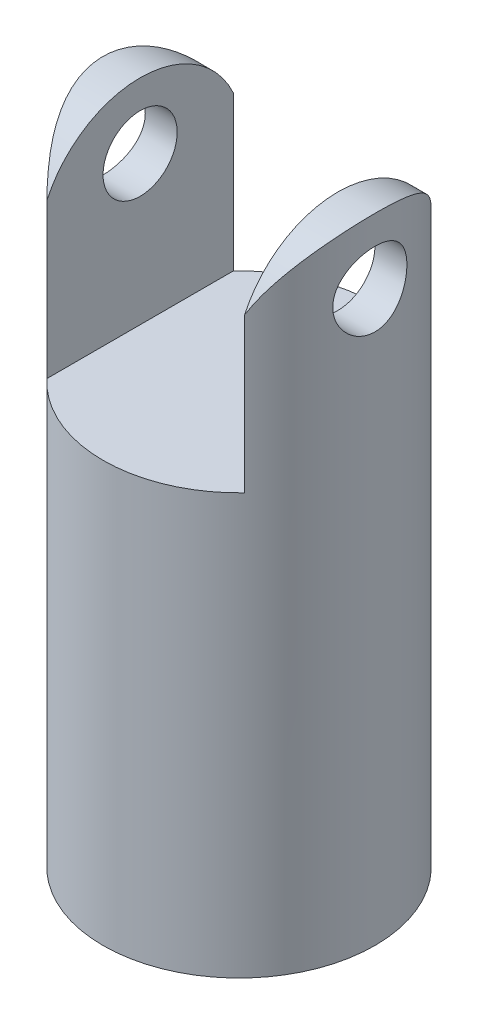
ISO-10303-21;
HEADER;
FILE_DESCRIPTION(('STEP AP214'),'2;1');
FILE_NAME('part.step','',(''),(''),'','','');
FILE_SCHEMA(('AUTOMOTIVE_DESIGN { 1 0 10303 214 1 1 1 1 }'));
ENDSEC;
DATA;
#1=APPLICATION_CONTEXT('core data for automotive mechanical design processes');
#2=APPLICATION_PROTOCOL_DEFINITION('international standard','automotive_design',2000,#1);
#3=PRODUCT_CONTEXT('',#1,'mechanical');
#4=PRODUCT('Part','Part','',(#3));
#5=PRODUCT_RELATED_PRODUCT_CATEGORY('part','',(#4));
#6=PRODUCT_DEFINITION_FORMATION('','',#4);
#7=PRODUCT_DEFINITION_CONTEXT('part definition',#1,'design');
#8=PRODUCT_DEFINITION('design','',#6,#7);
#9=PRODUCT_DEFINITION_SHAPE('','',#8);
#10=(LENGTH_UNIT() NAMED_UNIT(*) SI_UNIT(.MILLI.,.METRE.));
#11=(NAMED_UNIT(*) PLANE_ANGLE_UNIT() SI_UNIT($,.RADIAN.));
#12=(NAMED_UNIT(*) SI_UNIT($,.STERADIAN.) SOLID_ANGLE_UNIT());
#13=UNCERTAINTY_MEASURE_WITH_UNIT(LENGTH_MEASURE(1.E-05),#10,'distance_accuracy_value','');
#14=(GEOMETRIC_REPRESENTATION_CONTEXT(3) GLOBAL_UNCERTAINTY_ASSIGNED_CONTEXT((#13)) GLOBAL_UNIT_ASSIGNED_CONTEXT((#10,
#11,#12)) REPRESENTATION_CONTEXT('',''));
#15=CARTESIAN_POINT('',(0.,0.,0.));
#16=DIRECTION('',(0.,0.,1.));
#17=DIRECTION('',(1.,0.,0.));
#18=AXIS2_PLACEMENT_3D('',#15,#16,#17);
#19=CARTESIAN_POINT('',(4.,35.,-25.));
#20=DIRECTION('',(1.,0.,0.));
#21=DIRECTION('',(0.,1.,0.));
#22=AXIS2_PLACEMENT_3D('',#19,#20,#21);
#23=PLANE('',#22);
#24=CARTESIAN_POINT('',(4.,23.,0.));
#25=DIRECTION('',(1.,0.,0.));
#26=DIRECTION('',(0.,1.,0.));
#27=AXIS2_PLACEMENT_3D('',#24,#25,#26);
#28=CIRCLE('',#27,1.5);
#29=CARTESIAN_POINT('',(4.,24.5,0.));
#30=VERTEX_POINT('',#29);
#31=EDGE_CURVE('E118',#30,#30,#28,.T.);
#32=ORIENTED_EDGE('',*,*,#31,.T.);
#33=EDGE_LOOP('',(#32));
#34=FACE_BOUND('',#33,.T.);
#35=DIRECTION('',(0.,-1.,0.));
#36=VECTOR('',#35,1.);
#37=CARTESIAN_POINT('',(4.,26.,3.77491721763537));
#38=LINE('',#37,#36);
#39=CARTESIAN_POINT('',(4.,23.2320508075689,3.77491721763537));
#40=VERTEX_POINT('',#39);
#41=CARTESIAN_POINT('',(4.,17.,3.77491721763537));
#42=VERTEX_POINT('',#41);
#43=EDGE_CURVE('E105',#40,#42,#38,.T.);
#44=ORIENTED_EDGE('',*,*,#43,.F.);
#45=CARTESIAN_POINT('',(4.,21.5,0.));
#46=DIRECTION('',(1.,0.,0.));
#47=DIRECTION('',(0.,1.,0.));
#48=AXIS2_PLACEMENT_3D('',#45,#46,#47);
#49=CIRCLE('',#48,4.15331193145904);
#50=CARTESIAN_POINT('',(4.,23.2320508075689,-3.77491721763537));
#51=VERTEX_POINT('',#50);
#52=EDGE_CURVE('E96',#40,#51,#49,.F.);
#53=ORIENTED_EDGE('',*,*,#52,.T.);
#54=DIRECTION('',(0.,-1.,0.));
#55=VECTOR('',#54,1.);
#56=CARTESIAN_POINT('',(4.,26.,-3.77491721763537));
#57=LINE('',#56,#55);
#58=CARTESIAN_POINT('',(4.,17.,-3.77491721763537));
#59=VERTEX_POINT('',#58);
#60=EDGE_CURVE('E102',#59,#51,#57,.F.);
#61=ORIENTED_EDGE('',*,*,#60,.F.);
#62=DIRECTION('',(0.,0.,1.));
#63=VECTOR('',#62,1.);
#64=CARTESIAN_POINT('',(4.,17.,-25.));
#65=LINE('',#64,#63);
#66=EDGE_CURVE('E107',#59,#42,#65,.T.);
#67=ORIENTED_EDGE('',*,*,#66,.T.);
#68=EDGE_LOOP('',(#44,#53,#61,#67));
#69=FACE_BOUND('',#68,.T.);
#70=ADVANCED_FACE('F47',(#34,#69),#23,.F.);
#71=CARTESIAN_POINT('',(-4.,35.,-25.));
#72=DIRECTION('',(-1.,0.,0.));
#73=DIRECTION('',(0.,-1.,0.));
#74=AXIS2_PLACEMENT_3D('',#71,#72,#73);
#75=PLANE('',#74);
#76=CARTESIAN_POINT('',(-4.,23.,0.));
#77=DIRECTION('',(-1.,0.,0.));
#78=DIRECTION('',(0.,-1.,0.));
#79=AXIS2_PLACEMENT_3D('',#76,#77,#78);
#80=CIRCLE('',#79,1.5);
#81=CARTESIAN_POINT('',(-4.,21.5,0.));
#82=VERTEX_POINT('',#81);
#83=EDGE_CURVE('E116',#82,#82,#80,.T.);
#84=ORIENTED_EDGE('',*,*,#83,.T.);
#85=EDGE_LOOP('',(#84));
#86=FACE_BOUND('',#85,.T.);
#87=DIRECTION('',(0.,-1.,0.));
#88=VECTOR('',#87,1.);
#89=CARTESIAN_POINT('',(-4.,26.,-3.77491721763537));
#90=LINE('',#89,#88);
#91=CARTESIAN_POINT('',(-4.,23.2320508075689,-3.77491721763537));
#92=VERTEX_POINT('',#91);
#93=CARTESIAN_POINT('',(-4.,17.,-3.77491721763537));
#94=VERTEX_POINT('',#93);
#95=EDGE_CURVE('E92',#92,#94,#90,.T.);
#96=ORIENTED_EDGE('',*,*,#95,.F.);
#97=CARTESIAN_POINT('',(-4.,21.5,0.));
#98=DIRECTION('',(-1.,0.,0.));
#99=DIRECTION('',(0.,-1.,0.));
#100=AXIS2_PLACEMENT_3D('',#97,#98,#99);
#101=CIRCLE('',#100,4.15331193145904);
#102=CARTESIAN_POINT('',(-4.,23.2320508075689,3.77491721763537));
#103=VERTEX_POINT('',#102);
#104=EDGE_CURVE('E13',#92,#103,#101,.F.);
#105=ORIENTED_EDGE('',*,*,#104,.T.);
#106=DIRECTION('',(0.,-1.,0.));
#107=VECTOR('',#106,1.);
#108=CARTESIAN_POINT('',(-4.,26.,3.77491721763537));
#109=LINE('',#108,#107);
#110=CARTESIAN_POINT('',(-4.,17.,3.77491721763537));
#111=VERTEX_POINT('',#110);
#112=EDGE_CURVE('E95',#111,#103,#109,.F.);
#113=ORIENTED_EDGE('',*,*,#112,.F.);
#114=DIRECTION('',(0.,0.,1.));
#115=VECTOR('',#114,1.);
#116=CARTESIAN_POINT('',(-4.,17.,-25.));
#117=LINE('',#116,#115);
#118=EDGE_CURVE('E101',#94,#111,#117,.T.);
#119=ORIENTED_EDGE('',*,*,#118,.F.);
#120=EDGE_LOOP('',(#96,#105,#113,#119));
#121=FACE_BOUND('',#120,.T.);
#122=ADVANCED_FACE('F99',(#86,#121),#75,.F.);
#123=CARTESIAN_POINT('',(0.,26.,0.));
#124=DIRECTION('',(0.,-1.,0.));
#125=DIRECTION('',(0.,0.,-1.));
#126=AXIS2_PLACEMENT_3D('',#123,#124,#125);
#127=CYLINDRICAL_SURFACE('',#126,5.5);
#128=CARTESIAN_POINT('',(-5.29150262212918,23.,-1.5));
#129=CARTESIAN_POINT('',(-5.29150397933242,23.0825564510277,-1.4999981569703));
#130=CARTESIAN_POINT('',(-5.29345578048323,23.1651321099555,-1.49316121586719));
#131=CARTESIAN_POINT('',(-5.3010274190552,23.3278935253,-1.46604910592423));
#132=CARTESIAN_POINT('',(-5.30664898703923,23.4080781354985,-1.44576759691971));
#133=CARTESIAN_POINT('',(-5.32087717395131,23.5636791879618,-1.39248674622751));
#134=CARTESIAN_POINT('',(-5.32947946238205,23.6391023609042,-1.35950584697685));
#135=CARTESIAN_POINT('',(-5.34869425130277,23.7833581342367,-1.2818207402325));
#136=CARTESIAN_POINT('',(-5.35930693404948,23.8521901362373,-1.23711546969878));
#137=CARTESIAN_POINT('',(-5.38165786345274,23.9831102067913,-1.13599985857016));
#138=CARTESIAN_POINT('',(-5.39341679089298,24.045000328378,-1.07933774218464));
#139=CARTESIAN_POINT('',(-5.41655710292429,24.1585276577255,-0.956458027204654));
#140=CARTESIAN_POINT('',(-5.4279384467319,24.210163760916,-0.890239400501257));
#141=CARTESIAN_POINT('',(-5.44927272086847,24.3025486268105,-0.748747592415014));
#142=CARTESIAN_POINT('',(-5.45919841481043,24.3430997218264,-0.6733408831181));
#143=CARTESIAN_POINT('',(-5.4762652255866,24.4108728681829,-0.516463712056492));
#144=CARTESIAN_POINT('',(-5.48340683437022,24.4380972745742,-0.434994324603003));
#145=CARTESIAN_POINT('',(-5.49395456075485,24.4778010982805,-0.270371451848024));
#146=CARTESIAN_POINT('',(-5.4974458959785,24.4906174442147,-0.187304783419292));
#147=CARTESIAN_POINT('',(-5.50059802264474,24.5022023022979,-0.0201318714747489));
#148=CARTESIAN_POINT('',(-5.50025948354,24.5009732695445,0.0639741877907296));
#149=CARTESIAN_POINT('',(-5.49585206403333,24.4847376013516,0.228490060702586));
#150=CARTESIAN_POINT('',(-5.49188178563756,24.4700951266807,0.308938859429587));
#151=CARTESIAN_POINT('',(-5.48077394096948,24.4280376676544,0.466191004896713));
#152=CARTESIAN_POINT('',(-5.47363619004791,24.4006219386716,0.542994138822176));
#153=CARTESIAN_POINT('',(-5.45685088879515,24.333522864157,0.691693236894896));
#154=CARTESIAN_POINT('',(-5.44717834180867,24.2937165513123,0.763530775491583));
#155=CARTESIAN_POINT('',(-5.4263628785745,24.2030611057326,0.899629268661));
#156=CARTESIAN_POINT('',(-5.41521966459727,24.1522097356286,0.963888684077535));
#157=CARTESIAN_POINT('',(-5.39224620796906,24.0389820048791,1.08518074875882));
#158=CARTESIAN_POINT('',(-5.38040539296798,23.9762883280592,1.14191553261874));
#159=CARTESIAN_POINT('',(-5.35769198772825,23.8421547848866,1.24414076282169));
#160=CARTESIAN_POINT('',(-5.34681946230361,23.7707143338136,1.28963045681796));
#161=CARTESIAN_POINT('',(-5.32722971617593,23.6204456059996,1.36831504906637));
#162=CARTESIAN_POINT('',(-5.31852743967169,23.5415709942258,1.40142544272702));
#163=CARTESIAN_POINT('',(-5.30444735453973,23.3790773977709,1.45381649809065));
#164=CARTESIAN_POINT('',(-5.29906867769277,23.2954596583672,1.47310077178258));
#165=CARTESIAN_POINT('',(-5.29243075183376,23.12864781849,1.49677126460125));
#166=CARTESIAN_POINT('',(-5.29104827888985,23.0455218132359,1.50160329063472));
#167=CARTESIAN_POINT('',(-5.29222151202243,22.8796488564579,1.49746332611022));
#168=CARTESIAN_POINT('',(-5.29477677694071,22.7969018635137,1.48849288189024));
#169=CARTESIAN_POINT('',(-5.30341820279288,22.6358775626886,1.45739637961775));
#170=CARTESIAN_POINT('',(-5.3094315020934,22.5575435793702,1.43554156609381));
#171=CARTESIAN_POINT('',(-5.32423951436502,22.4056539900694,1.37960331838531));
#172=CARTESIAN_POINT('',(-5.33303460273288,22.3320990306223,1.34551823366713));
#173=CARTESIAN_POINT('',(-5.3526656797527,22.189999291833,1.26519240779034));
#174=CARTESIAN_POINT('',(-5.36354371589181,22.121607425495,1.21869167395158));
#175=CARTESIAN_POINT('',(-5.3860176273416,21.9934339346148,1.11517441622706));
#176=CARTESIAN_POINT('',(-5.39761364372337,21.9336540098999,1.05815582137422));
#177=CARTESIAN_POINT('',(-5.42064365021152,21.8225336360494,0.933153363001187));
#178=CARTESIAN_POINT('',(-5.43206199790196,21.7715049965658,0.8648888475196));
#179=CARTESIAN_POINT('',(-5.45308956662174,21.681629364909,0.720505557506886));
#180=CARTESIAN_POINT('',(-5.46269888388575,21.6427817246722,0.644387201108797));
#181=CARTESIAN_POINT('',(-5.47896373225224,21.5787329337421,0.48699233815191));
#182=CARTESIAN_POINT('',(-5.48564141597945,21.5534291096995,0.405760013245424));
#183=CARTESIAN_POINT('',(-5.49538823820121,21.5168930474549,0.239985864722818));
#184=CARTESIAN_POINT('',(-5.4984582160406,21.5056575361731,0.155444815623817));
#185=CARTESIAN_POINT('',(-5.50060207356917,21.4977898799094,-0.0116397196820234));
#186=CARTESIAN_POINT('',(-5.49980084994582,21.5007013286933,-0.0941604093051925));
#187=CARTESIAN_POINT('',(-5.4945768528746,21.51997977731,-0.257491304637166));
#188=CARTESIAN_POINT('',(-5.49015422670854,21.5363462299303,-0.338301579771118));
#189=CARTESIAN_POINT('',(-5.47821112917835,21.5818073703395,-0.49534203369685));
#190=CARTESIAN_POINT('',(-5.47071413494114,21.6108056982402,-0.571602011794993));
#191=CARTESIAN_POINT('',(-5.45340440920124,21.6806216215351,-0.718217369622537));
#192=CARTESIAN_POINT('',(-5.44359134174256,21.7214409318066,-0.788571890732096));
#193=CARTESIAN_POINT('',(-5.42235787347661,21.8150547282817,-0.923488675195432));
#194=CARTESIAN_POINT('',(-5.41090053751388,21.8681490724366,-0.987837043212875));
#195=CARTESIAN_POINT('',(-5.38781343748961,21.9842421385502,-1.10686496193089));
#196=CARTESIAN_POINT('',(-5.37618362817694,22.0472435029512,-1.16154192474211));
#197=CARTESIAN_POINT('',(-5.35375507792812,22.1831275268309,-1.2609396606189));
#198=CARTESIAN_POINT('',(-5.34298201162846,22.2562062026808,-1.30539879787935));
#199=CARTESIAN_POINT('',(-5.32385655741428,22.4090859451496,-1.3813380630303));
#200=CARTESIAN_POINT('',(-5.31550265682104,22.4888827705103,-1.41282630671052));
#201=CARTESIAN_POINT('',(-5.30326481572331,22.6402680192525,-1.45802611152119));
#202=CARTESIAN_POINT('',(-5.29889066810921,22.7112284687515,-1.47372831222932));
#203=CARTESIAN_POINT('',(-5.29300915582115,22.8547877979027,-1.494715407894));
#204=CARTESIAN_POINT('',(-5.29150142838456,22.9273864690513,-1.5000016210592));
#205=CARTESIAN_POINT('',(-5.29150262212918,23.,-1.5));
#206=B_SPLINE_CURVE_WITH_KNOTS('',3,(#128,#129,#130,#131,#132,#133,#134,#135,#136,#137,#138,
#139,#140,#141,#142,#143,#144,#145,#146,#147,#148,#149,#150,#151,#152,#153,#154,#155,#156,#157,
#158,#159,#160,#161,#162,#163,#164,#165,#166,#167,#168,#169,#170,#171,#172,#173,#174,#175,#176,
#177,#178,#179,#180,#181,#182,#183,#184,#185,#186,#187,#188,#189,#190,#191,#192,#193,#194,#195,
#196,#197,#198,#199,#200,#201,#202,#203,#204,#205),.UNSPECIFIED.,.T.,.F.,(4,2,2,2,2,2,2,2,2,2,2,
2,2,2,2,2,2,2,2,2,2,2,2,2,2,2,2,2,2,2,2,2,2,2,2,2,2,2,4),(0.,0.247402201391972,
0.494921155336744,0.742082002291412,0.989265266888855,1.24229327000826,1.49534851471804,
1.75265882819586,2.00992365416647,2.26103843021061,2.51210931268385,2.75655962385664,
3.0010241872433,3.24799669713118,3.49501928234234,3.74996416866223,4.00492610732058,
4.26159801830626,4.51820285087414,4.76680611540842,5.01538153009582,5.25890187447338,
5.50245509545499,5.75157425489229,6.00074251835821,6.25748556676549,6.51421495339718,
6.76896951768223,7.02366480072505,7.27019876040455,7.51672269408902,7.7613981255949,
8.00610907011738,8.25758505394756,8.50912822664455,8.76653181226182,9.02377409687475,
9.24140725781328,9.45901287413894),.UNSPECIFIED.);
#207=CARTESIAN_POINT('',(-5.29150262212918,23.,-1.5));
#208=VERTEX_POINT('',#207);
#209=EDGE_CURVE('E155',#208,#208,#206,.T.);
#210=ORIENTED_EDGE('',*,*,#209,.T.);
#211=EDGE_LOOP('',(#210));
#212=FACE_BOUND('',#211,.T.);
#213=CARTESIAN_POINT('',(5.29150262212918,23.,-1.5));
#214=CARTESIAN_POINT('',(5.29150397933242,22.9174435489722,-1.4999981569703));
#215=CARTESIAN_POINT('',(5.29345578048323,22.8348678900445,-1.49316121586719));
#216=CARTESIAN_POINT('',(5.3010274190552,22.6721064747,-1.46604910592423));
#217=CARTESIAN_POINT('',(5.30664898703923,22.5919218645014,-1.44576759691971));
#218=CARTESIAN_POINT('',(5.32087717395131,22.4363208120381,-1.39248674622751));
#219=CARTESIAN_POINT('',(5.32947946238205,22.3608976390958,-1.35950584697685));
#220=CARTESIAN_POINT('',(5.34869425130277,22.2166418657633,-1.2818207402325));
#221=CARTESIAN_POINT('',(5.35930693404948,22.1478098637627,-1.23711546969878));
#222=CARTESIAN_POINT('',(5.38165786345274,22.0168897932086,-1.13599985857016));
#223=CARTESIAN_POINT('',(5.39341679089298,21.9549996716219,-1.07933774218464));
#224=CARTESIAN_POINT('',(5.41655710292429,21.8414723422745,-0.956458027204653));
#225=CARTESIAN_POINT('',(5.4279384467319,21.789836239084,-0.890239400501256));
#226=CARTESIAN_POINT('',(5.44927272086847,21.6974513731895,-0.748747592415014));
#227=CARTESIAN_POINT('',(5.45919841481043,21.6569002781735,-0.673340883118099));
#228=CARTESIAN_POINT('',(5.4762652255866,21.5891271318171,-0.516463712056491));
#229=CARTESIAN_POINT('',(5.48340683437022,21.5619027254258,-0.434994324603003));
#230=CARTESIAN_POINT('',(5.49395456075485,21.5221989017194,-0.270371451848024));
#231=CARTESIAN_POINT('',(5.4974458959785,21.5093825557852,-0.187304783419292));
#232=CARTESIAN_POINT('',(5.50059802264474,21.497797697702,-0.0201318714747491));
#233=CARTESIAN_POINT('',(5.50025948354,21.4990267304555,0.0639741877907296));
#234=CARTESIAN_POINT('',(5.49585206403333,21.5152623986484,0.228490060702586));
#235=CARTESIAN_POINT('',(5.49188178563756,21.5299048733192,0.308938859429587));
#236=CARTESIAN_POINT('',(5.48077394096948,21.5719623323456,0.466191004896713));
#237=CARTESIAN_POINT('',(5.47363619004791,21.5993780613283,0.542994138822176));
#238=CARTESIAN_POINT('',(5.45685088879515,21.666477135843,0.691693236894896));
#239=CARTESIAN_POINT('',(5.44717834180867,21.7062834486877,0.763530775491583));
#240=CARTESIAN_POINT('',(5.4263628785745,21.7969388942674,0.899629268661));
#241=CARTESIAN_POINT('',(5.41521966459727,21.8477902643713,0.963888684077535));
#242=CARTESIAN_POINT('',(5.39224620796906,21.9610179951208,1.08518074875882));
#243=CARTESIAN_POINT('',(5.38040539296798,22.0237116719408,1.14191553261874));
#244=CARTESIAN_POINT('',(5.35769198772825,22.1578452151133,1.24414076282169));
#245=CARTESIAN_POINT('',(5.34681946230361,22.2292856661864,1.28963045681796));
#246=CARTESIAN_POINT('',(5.32722971617593,22.3795543940003,1.36831504906637));
#247=CARTESIAN_POINT('',(5.31852743967169,22.4584290057742,1.40142544272702));
#248=CARTESIAN_POINT('',(5.30444735453973,22.6209226022291,1.45381649809065));
#249=CARTESIAN_POINT('',(5.29906867769277,22.7045403416328,1.47310077178258));
#250=CARTESIAN_POINT('',(5.29243075183376,22.87135218151,1.49677126460125));
#251=CARTESIAN_POINT('',(5.29104827888985,22.9544781867641,1.50160329063472));
#252=CARTESIAN_POINT('',(5.29222151202243,23.120351143542,1.49746332611022));
#253=CARTESIAN_POINT('',(5.29477677694071,23.2030981364863,1.48849288189024));
#254=CARTESIAN_POINT('',(5.30341820279288,23.3641224373113,1.45739637961775));
#255=CARTESIAN_POINT('',(5.3094315020934,23.4424564206298,1.43554156609381));
#256=CARTESIAN_POINT('',(5.32423951436502,23.5943460099306,1.37960331838531));
#257=CARTESIAN_POINT('',(5.33303460273288,23.6679009693777,1.34551823366713));
#258=CARTESIAN_POINT('',(5.3526656797527,23.810000708167,1.26519240779034));
#259=CARTESIAN_POINT('',(5.36354371589181,23.878392574505,1.21869167395158));
#260=CARTESIAN_POINT('',(5.3860176273416,24.0065660653851,1.11517441622706));
#261=CARTESIAN_POINT('',(5.39761364372337,24.0663459901001,1.05815582137422));
#262=CARTESIAN_POINT('',(5.42064365021152,24.1774663639506,0.933153363001187));
#263=CARTESIAN_POINT('',(5.43206199790196,24.2284950034342,0.864888847519599));
#264=CARTESIAN_POINT('',(5.45308956662174,24.318370635091,0.720505557506885));
#265=CARTESIAN_POINT('',(5.46269888388575,24.3572182753278,0.644387201108796));
#266=CARTESIAN_POINT('',(5.47896373225224,24.4212670662579,0.48699233815191));
#267=CARTESIAN_POINT('',(5.48564141597945,24.4465708903005,0.405760013245424));
#268=CARTESIAN_POINT('',(5.49538823820121,24.4831069525451,0.239985864722818));
#269=CARTESIAN_POINT('',(5.4984582160406,24.4943424638269,0.155444815623817));
#270=CARTESIAN_POINT('',(5.50060207356917,24.5022101200906,-0.0116397196820234));
#271=CARTESIAN_POINT('',(5.49980084994582,24.4992986713067,-0.0941604093051925));
#272=CARTESIAN_POINT('',(5.4945768528746,24.48002022269,-0.257491304637166));
#273=CARTESIAN_POINT('',(5.49015422670854,24.4636537700697,-0.338301579771118));
#274=CARTESIAN_POINT('',(5.47821112917835,24.4181926296605,-0.49534203369685));
#275=CARTESIAN_POINT('',(5.47071413494114,24.3891943017597,-0.571602011794993));
#276=CARTESIAN_POINT('',(5.45340440920124,24.3193783784649,-0.718217369622537));
#277=CARTESIAN_POINT('',(5.44359134174256,24.2785590681934,-0.788571890732096));
#278=CARTESIAN_POINT('',(5.42235787347661,24.1849452717183,-0.923488675195432));
#279=CARTESIAN_POINT('',(5.41090053751388,24.1318509275633,-0.987837043212875));
#280=CARTESIAN_POINT('',(5.38781343748961,24.0157578614498,-1.10686496193089));
#281=CARTESIAN_POINT('',(5.37618362817694,23.9527564970487,-1.16154192474211));
#282=CARTESIAN_POINT('',(5.35375507792812,23.8168724731691,-1.2609396606189));
#283=CARTESIAN_POINT('',(5.34298201162846,23.7437937973192,-1.30539879787935));
#284=CARTESIAN_POINT('',(5.32385655741428,23.5909140548504,-1.3813380630303));
#285=CARTESIAN_POINT('',(5.31550265682104,23.5111172294897,-1.41282630671052));
#286=CARTESIAN_POINT('',(5.30326481572331,23.3597319807474,-1.45802611152119));
#287=CARTESIAN_POINT('',(5.29889066810921,23.2887715312485,-1.47372831222932));
#288=CARTESIAN_POINT('',(5.29300915582115,23.1452122020973,-1.494715407894));
#289=CARTESIAN_POINT('',(5.29150142838456,23.0726135309487,-1.5000016210592));
#290=CARTESIAN_POINT('',(5.29150262212918,23.,-1.5));
#291=B_SPLINE_CURVE_WITH_KNOTS('',3,(#213,#214,#215,#216,#217,#218,#219,#220,#221,#222,#223,
#224,#225,#226,#227,#228,#229,#230,#231,#232,#233,#234,#235,#236,#237,#238,#239,#240,#241,#242,
#243,#244,#245,#246,#247,#248,#249,#250,#251,#252,#253,#254,#255,#256,#257,#258,#259,#260,#261,
#262,#263,#264,#265,#266,#267,#268,#269,#270,#271,#272,#273,#274,#275,#276,#277,#278,#279,#280,
#281,#282,#283,#284,#285,#286,#287,#288,#289,#290),.UNSPECIFIED.,.T.,.F.,(4,2,2,2,2,2,2,2,2,2,2,
2,2,2,2,2,2,2,2,2,2,2,2,2,2,2,2,2,2,2,2,2,2,2,2,2,2,2,4),(0.,0.247402201391972,
0.494921155336744,0.742082002291415,0.989265266888855,1.24229327000826,1.49534851471804,
1.75265882819586,2.00992365416647,2.26103843021061,2.51210931268385,2.75655962385664,
3.0010241872433,3.24799669713118,3.49501928234234,3.74996416866223,4.00492610732058,
4.26159801830626,4.51820285087414,4.76680611540842,5.01538153009582,5.25890187447338,
5.50245509545499,5.75157425489229,6.00074251835821,6.25748556676549,6.51421495339718,
6.76896951768224,7.02366480072506,7.27019876040455,7.51672269408903,7.7613981255949,
8.00610907011738,8.25758505394756,8.50912822664455,8.76653181226183,9.02377409687476,
9.24140725781328,9.45901287413894),.UNSPECIFIED.);
#292=CARTESIAN_POINT('',(5.29150262212918,23.,-1.5));
#293=VERTEX_POINT('',#292);
#294=EDGE_CURVE('E122',#293,#293,#291,.T.);
#295=ORIENTED_EDGE('',*,*,#294,.T.);
#296=EDGE_LOOP('',(#295));
#297=FACE_BOUND('',#296,.T.);
#298=ORIENTED_EDGE('',*,*,#112,.T.);
#299=CARTESIAN_POINT('',(-3.60555127546399,21.5,4.15331193145904));
#300=CARTESIAN_POINT('',(-3.60547040250049,21.5976537652712,4.15334445103078));
#301=CARTESIAN_POINT('',(-3.60951656871601,21.6952526292036,4.14986954341714));
#302=CARTESIAN_POINT('',(-3.6252271787589,21.8891426539515,4.13617188406569));
#303=CARTESIAN_POINT('',(-3.63687432100341,21.9854362788915,4.12596445654146));
#304=CARTESIAN_POINT('',(-3.66694769951464,22.1746569621928,4.09925193730759));
#305=CARTESIAN_POINT('',(-3.68527830376266,22.2676121272456,4.08283556980207));
#306=CARTESIAN_POINT('',(-3.72778055764887,22.4509458957926,4.04406779635878));
#307=CARTESIAN_POINT('',(-3.75195577934866,22.54132288567,4.02171276004906));
#308=CARTESIAN_POINT('',(-3.81072273658934,22.7378064480999,3.96614990671222));
#309=CARTESIAN_POINT('',(-3.84643602736842,22.8432107771946,3.9316475794461));
#310=CARTESIAN_POINT('',(-3.9231300880453,23.0492203124615,3.85512597544404));
#311=CARTESIAN_POINT('',(-3.964111901597,23.1498245623462,3.81310520871511));
#312=CARTESIAN_POINT('',(-4.09299844356465,23.4453281854628,3.67601125613255));
#313=CARTESIAN_POINT('',(-4.18650794315925,23.6328944510109,3.57020438033287));
#314=CARTESIAN_POINT('',(-4.38006375488353,23.9916226206615,3.33007554588051));
#315=CARTESIAN_POINT('',(-4.48020635517096,24.1623549541508,3.19519909229987));
#316=CARTESIAN_POINT('',(-4.67694467230511,24.4815280381837,2.89960074407404));
#317=CARTESIAN_POINT('',(-4.77354658693113,24.6300092991662,2.73892694918007));
#318=CARTESIAN_POINT('',(-4.95257244117467,24.8966599393664,2.39942686972138));
#319=CARTESIAN_POINT('',(-5.03541618112195,25.0158250947115,2.22161940523791));
#320=CARTESIAN_POINT('',(-5.14786880233851,25.1744965925157,1.93901504320507));
#321=CARTESIAN_POINT('',(-5.18340147065904,25.2240641228168,1.84210348348945));
#322=CARTESIAN_POINT('',(-5.24978738322213,25.3159245811212,1.64337644867618));
#323=CARTESIAN_POINT('',(-5.28064290210647,25.3582210466179,1.5415633892782));
#324=CARTESIAN_POINT('',(-5.33723823615638,25.4353275615042,1.33256278162993));
#325=CARTESIAN_POINT('',(-5.36292579890519,25.470061410006,1.22533284316755));
#326=CARTESIAN_POINT('',(-5.4081290822959,25.5309149837235,1.00723893743802));
#327=CARTESIAN_POINT('',(-5.42764817913843,25.5570394214843,0.896376994885952));
#328=CARTESIAN_POINT('',(-5.45996620152354,25.6001749867533,0.672014890769008));
#329=CARTESIAN_POINT('',(-5.47277036003147,25.6171932109635,0.558516855769085));
#330=CARTESIAN_POINT('',(-5.49129147568882,25.641780813524,0.329935768269791));
#331=CARTESIAN_POINT('',(-5.4970097018813,25.649351883798,0.214853003318929));
#332=CARTESIAN_POINT('',(-5.50086818314378,25.6544616191678,0.00191325379482998));
#333=CARTESIAN_POINT('',(-5.50003042718692,25.6533532681761,-0.0958963109978608));
#334=CARTESIAN_POINT('',(-5.49316190230219,25.6442534707143,-0.291043486589168));
#335=CARTESIAN_POINT('',(-5.48712955395367,25.636259930796,-0.38838094479046));
#336=CARTESIAN_POINT('',(-5.47000506018238,25.6135157601249,-0.58177422543297));
#337=CARTESIAN_POINT('',(-5.45891487560159,25.5987677479632,-0.677830529717118));
#338=CARTESIAN_POINT('',(-5.43192050014674,25.5627452967543,-0.868036486986254));
#339=CARTESIAN_POINT('',(-5.41601443317236,25.5414683142036,-0.962185381633183));
#340=CARTESIAN_POINT('',(-5.36264175550506,25.4697541638921,-1.23516831895388));
#341=CARTESIAN_POINT('',(-5.31894494002206,25.410683514933,-1.41061482164376));
#342=CARTESIAN_POINT('',(-5.21763868152048,25.2717376146884,-1.74856317630322));
#343=CARTESIAN_POINT('',(-5.1600268513403,25.1918587935152,-1.91106280082991));
#344=CARTESIAN_POINT('',(-5.02595888686376,25.0021928159957,-2.24178892176472));
#345=CARTESIAN_POINT('',(-4.94801917612083,24.889849672731,-2.40794041317521));
#346=CARTESIAN_POINT('',(-4.78355620122666,24.6449463776872,-2.7200651203762));
#347=CARTESIAN_POINT('',(-4.69702292236105,24.5123625389856,-2.86601430756722));
#348=CARTESIAN_POINT('',(-4.55584894742765,24.2857078429398,-3.08280741429558));
#349=CARTESIAN_POINT('',(-4.50223781597343,24.1973388840586,-3.16040697016601));
#350=CARTESIAN_POINT('',(-4.39504549079252,24.0143451275046,-3.30785011847919));
#351=CARTESIAN_POINT('',(-4.34146429308014,23.9197217046599,-3.37769540644449));
#352=CARTESIAN_POINT('',(-4.23565932684829,23.7243120587831,-3.50946296315179));
#353=CARTESIAN_POINT('',(-4.18343615230125,23.6235232016367,-3.57138180997259));
#354=CARTESIAN_POINT('',(-4.08198176910243,23.4159239660317,-3.68691458686422));
#355=CARTESIAN_POINT('',(-4.03274938588635,23.3091159836314,-3.74053179019498));
#356=CARTESIAN_POINT('',(-3.91948216930946,23.0434574612212,-3.85965243764111));
#357=CARTESIAN_POINT('',(-3.85787041822836,22.8815269645307,-3.92074558683356));
#358=CARTESIAN_POINT('',(-3.75113787165504,22.5468488919203,-4.02299360084131));
#359=CARTESIAN_POINT('',(-3.70594534100126,22.3741523285229,-4.06423545870904));
#360=CARTESIAN_POINT('',(-3.65081081572278,22.0838279875265,-4.11368628795512));
#361=CARTESIAN_POINT('',(-3.63404142074593,21.9686134788316,-4.12843502540582));
#362=CARTESIAN_POINT('',(-3.61705550099533,21.7940723544053,-4.14330338521387));
#363=CARTESIAN_POINT('',(-3.6127543860935,21.7354258693232,-4.14705060823876));
#364=CARTESIAN_POINT('',(-3.60699694725637,21.6178577496237,-4.15205721680613));
#365=CARTESIAN_POINT('',(-3.60554209912899,21.5589359881359,-4.15331531172323));
#366=CARTESIAN_POINT('',(-3.60555127546399,21.5,-4.15331193145904));
#367=B_SPLINE_CURVE_WITH_KNOTS('',3,(#299,#300,#301,#302,#303,#304,#305,#306,#307,#308,#309,
#310,#311,#312,#313,#314,#315,#316,#317,#318,#319,#320,#321,#322,#323,#324,#325,#326,#327,#328,
#329,#330,#331,#332,#333,#334,#335,#336,#337,#338,#339,#340,#341,#342,#343,#344,#345,#346,#347,
#348,#349,#350,#351,#352,#353,#354,#355,#356,#357,#358,#359,#360,#361,#362,#363,#364,#365,#366),
.UNSPECIFIED.,.F.,.F.,(4,2,2,2,2,2,2,2,2,2,2,2,2,2,2,2,2,2,2,2,2,2,2,2,2,2,2,2,2,2,2,2,2,4),(0.,
0.292728216601007,0.584792429144946,0.872831813958145,1.1610476871561,1.51004508903029,
1.85911173144474,2.56055866198317,3.2768041674504,3.99172940200932,4.67724064531699,
5.0203972876737,5.36338650322484,5.70968631736051,6.05579626082551,6.40163607777832,
6.74741394817879,7.04050022963745,7.33367565573009,7.62673751890397,7.91991369600548,
8.48804405790041,9.05627195353878,9.69949918423067,10.3434850129496,10.7308932279985,
11.1182165661161,11.5057065555705,11.8930433701425,12.4424107538034,12.9893482520635,
13.3405267001499,13.517185075489,13.6939350250995),.UNSPECIFIED.);
#368=EDGE_CURVE('E69',#103,#92,#367,.T.);
#369=ORIENTED_EDGE('',*,*,#368,.T.);
#370=ORIENTED_EDGE('',*,*,#95,.T.);
#371=CARTESIAN_POINT('',(0.,17.,0.));
#372=DIRECTION('',(0.,-1.,0.));
#373=DIRECTION('',(0.,0.,-1.));
#374=AXIS2_PLACEMENT_3D('',#371,#372,#373);
#375=CIRCLE('',#374,5.5);
#376=EDGE_CURVE('E56',#94,#59,#375,.T.);
#377=ORIENTED_EDGE('',*,*,#376,.T.);
#378=ORIENTED_EDGE('',*,*,#60,.T.);
#379=CARTESIAN_POINT('',(3.60555127546399,21.5,-4.15331193145904));
#380=CARTESIAN_POINT('',(3.60547040250049,21.5976537652712,-4.15334445103078));
#381=CARTESIAN_POINT('',(3.60951656871601,21.6952526292036,-4.14986954341714));
#382=CARTESIAN_POINT('',(3.6252271787589,21.8891426539515,-4.13617188406569));
#383=CARTESIAN_POINT('',(3.63687432100341,21.9854362788915,-4.12596445654146));
#384=CARTESIAN_POINT('',(3.66694769951464,22.1746569621928,-4.09925193730759));
#385=CARTESIAN_POINT('',(3.68527830376266,22.2676121272456,-4.08283556980207));
#386=CARTESIAN_POINT('',(3.72778055764887,22.4509458957926,-4.04406779635878));
#387=CARTESIAN_POINT('',(3.75195577934866,22.54132288567,-4.02171276004906));
#388=CARTESIAN_POINT('',(3.81072273658934,22.7378064480999,-3.96614990671222));
#389=CARTESIAN_POINT('',(3.84643602736842,22.8432107771946,-3.9316475794461));
#390=CARTESIAN_POINT('',(3.9231300880453,23.0492203124615,-3.85512597544404));
#391=CARTESIAN_POINT('',(3.964111901597,23.1498245623462,-3.81310520871511));
#392=CARTESIAN_POINT('',(4.09299844356465,23.4453281854628,-3.67601125613255));
#393=CARTESIAN_POINT('',(4.18650794315925,23.6328944510109,-3.57020438033287));
#394=CARTESIAN_POINT('',(4.38006375488353,23.9916226206615,-3.33007554588051));
#395=CARTESIAN_POINT('',(4.48020635517096,24.1623549541508,-3.19519909229987));
#396=CARTESIAN_POINT('',(4.67694467230511,24.4815280381837,-2.89960074407404));
#397=CARTESIAN_POINT('',(4.77354658693113,24.6300092991662,-2.73892694918007));
#398=CARTESIAN_POINT('',(4.95257244117467,24.8966599393664,-2.39942686972138));
#399=CARTESIAN_POINT('',(5.03541618112195,25.0158250947115,-2.22161940523791));
#400=CARTESIAN_POINT('',(5.14786880233851,25.1744965925157,-1.93901504320507));
#401=CARTESIAN_POINT('',(5.18340147065904,25.2240641228168,-1.84210348348945));
#402=CARTESIAN_POINT('',(5.24978738322213,25.3159245811212,-1.64337644867618));
#403=CARTESIAN_POINT('',(5.28064290210647,25.3582210466179,-1.5415633892782));
#404=CARTESIAN_POINT('',(5.33723823615638,25.4353275615042,-1.33256278162993));
#405=CARTESIAN_POINT('',(5.36292579890519,25.470061410006,-1.22533284316755));
#406=CARTESIAN_POINT('',(5.4081290822959,25.5309149837235,-1.00723893743802));
#407=CARTESIAN_POINT('',(5.42764817913843,25.5570394214843,-0.896376994885952));
#408=CARTESIAN_POINT('',(5.45996620152354,25.6001749867533,-0.672014890769008));
#409=CARTESIAN_POINT('',(5.47277036003147,25.6171932109635,-0.558516855769085));
#410=CARTESIAN_POINT('',(5.49129147568882,25.641780813524,-0.329935768269791));
#411=CARTESIAN_POINT('',(5.4970097018813,25.649351883798,-0.214853003318929));
#412=CARTESIAN_POINT('',(5.50086818314378,25.6544616191678,-0.00191325379482998));
#413=CARTESIAN_POINT('',(5.50003042718692,25.6533532681761,0.0958963109978608));
#414=CARTESIAN_POINT('',(5.49316190230219,25.6442534707143,0.291043486589168));
#415=CARTESIAN_POINT('',(5.48712955395367,25.636259930796,0.38838094479046));
#416=CARTESIAN_POINT('',(5.47000506018238,25.6135157601249,0.58177422543297));
#417=CARTESIAN_POINT('',(5.45891487560159,25.5987677479632,0.677830529717118));
#418=CARTESIAN_POINT('',(5.43192050014674,25.5627452967543,0.868036486986254));
#419=CARTESIAN_POINT('',(5.41601443317236,25.5414683142036,0.962185381633183));
#420=CARTESIAN_POINT('',(5.36264175550506,25.4697541638921,1.23516831895388));
#421=CARTESIAN_POINT('',(5.31894494002206,25.410683514933,1.41061482164376));
#422=CARTESIAN_POINT('',(5.21763868152048,25.2717376146884,1.74856317630322));
#423=CARTESIAN_POINT('',(5.1600268513403,25.1918587935152,1.91106280082991));
#424=CARTESIAN_POINT('',(5.02595888686376,25.0021928159957,2.24178892176472));
#425=CARTESIAN_POINT('',(4.94801917612083,24.889849672731,2.40794041317521));
#426=CARTESIAN_POINT('',(4.78355620122666,24.6449463776872,2.7200651203762));
#427=CARTESIAN_POINT('',(4.69702292236105,24.5123625389856,2.86601430756722));
#428=CARTESIAN_POINT('',(4.55584894742765,24.2857078429398,3.08280741429558));
#429=CARTESIAN_POINT('',(4.50223781597343,24.1973388840586,3.16040697016601));
#430=CARTESIAN_POINT('',(4.39504549079252,24.0143451275046,3.30785011847919));
#431=CARTESIAN_POINT('',(4.34146429308014,23.9197217046599,3.37769540644449));
#432=CARTESIAN_POINT('',(4.23565932684829,23.7243120587831,3.50946296315179));
#433=CARTESIAN_POINT('',(4.18343615230125,23.6235232016367,3.57138180997259));
#434=CARTESIAN_POINT('',(4.08198176910243,23.4159239660317,3.68691458686422));
#435=CARTESIAN_POINT('',(4.03274938588635,23.3091159836314,3.74053179019498));
#436=CARTESIAN_POINT('',(3.91948216930946,23.0434574612212,3.85965243764111));
#437=CARTESIAN_POINT('',(3.85787041822836,22.8815269645307,3.92074558683356));
#438=CARTESIAN_POINT('',(3.75113787165504,22.5468488919203,4.02299360084131));
#439=CARTESIAN_POINT('',(3.70594534100126,22.3741523285229,4.06423545870904));
#440=CARTESIAN_POINT('',(3.65081081572278,22.0838279875265,4.11368628795512));
#441=CARTESIAN_POINT('',(3.63404142074593,21.9686134788316,4.12843502540582));
#442=CARTESIAN_POINT('',(3.61705550099533,21.7940723544053,4.14330338521387));
#443=CARTESIAN_POINT('',(3.6127543860935,21.7354258693232,4.14705060823876));
#444=CARTESIAN_POINT('',(3.60699694725637,21.6178577496237,4.15205721680613));
#445=CARTESIAN_POINT('',(3.60554209912899,21.5589359881359,4.15331531172323));
#446=CARTESIAN_POINT('',(3.60555127546399,21.5,4.15331193145904));
#447=B_SPLINE_CURVE_WITH_KNOTS('',3,(#379,#380,#381,#382,#383,#384,#385,#386,#387,#388,#389,
#390,#391,#392,#393,#394,#395,#396,#397,#398,#399,#400,#401,#402,#403,#404,#405,#406,#407,#408,
#409,#410,#411,#412,#413,#414,#415,#416,#417,#418,#419,#420,#421,#422,#423,#424,#425,#426,#427,
#428,#429,#430,#431,#432,#433,#434,#435,#436,#437,#438,#439,#440,#441,#442,#443,#444,#445,#446),
.UNSPECIFIED.,.F.,.F.,(4,2,2,2,2,2,2,2,2,2,2,2,2,2,2,2,2,2,2,2,2,2,2,2,2,2,2,2,2,2,2,2,2,4),(0.,
0.292728216601007,0.584792429144946,0.872831813958145,1.1610476871561,1.51004508903029,
1.85911173144474,2.56055866198317,3.2768041674504,3.99172940200932,4.67724064531699,
5.0203972876737,5.36338650322484,5.70968631736051,6.05579626082551,6.40163607777832,
6.74741394817879,7.04050022963745,7.33367565573009,7.62673751890397,7.91991369600548,
8.48804405790041,9.05627195353878,9.69949918423067,10.3434850129496,10.7308932279985,
11.1182165661161,11.5057065555705,11.8930433701425,12.4424107538034,12.9893482520635,
13.3405267001499,13.517185075489,13.6939350250995),.UNSPECIFIED.);
#448=EDGE_CURVE('E62',#51,#40,#447,.T.);
#449=ORIENTED_EDGE('',*,*,#448,.T.);
#450=ORIENTED_EDGE('',*,*,#43,.T.);
#451=EDGE_CURVE('E115',#42,#111,#375,.T.);
#452=ORIENTED_EDGE('',*,*,#451,.T.);
#453=EDGE_LOOP('',(#298,#369,#370,#377,#378,#449,#450,#452));
#454=FACE_BOUND('',#453,.T.);
#455=CARTESIAN_POINT('',(0.,0.,0.));
#456=DIRECTION('',(0.,1.,0.));
#457=DIRECTION('',(0.,0.,1.));
#458=AXIS2_PLACEMENT_3D('',#455,#456,#457);
#459=CIRCLE('',#458,5.5);
#460=CARTESIAN_POINT('',(0.,0.,5.5));
#461=VERTEX_POINT('',#460);
#462=EDGE_CURVE('E112',#461,#461,#459,.T.);
#463=ORIENTED_EDGE('',*,*,#462,.T.);
#464=EDGE_LOOP('',(#463));
#465=FACE_BOUND('',#464,.T.);
#466=ADVANCED_FACE('F49',(#212,#297,#454,#465),#127,.T.);
#467=CARTESIAN_POINT('',(0.,0.,0.));
#468=DIRECTION('',(0.,1.,0.));
#469=DIRECTION('',(0.,0.,1.));
#470=AXIS2_PLACEMENT_3D('',#467,#468,#469);
#471=PLANE('',#470);
#472=ORIENTED_EDGE('',*,*,#462,.F.);
#473=EDGE_LOOP('',(#472));
#474=FACE_BOUND('',#473,.T.);
#475=ADVANCED_FACE('F172',(#474),#471,.F.);
#476=CARTESIAN_POINT('',(-4.,17.,-25.));
#477=DIRECTION('',(0.,-1.,0.));
#478=DIRECTION('',(0.,0.,-1.));
#479=AXIS2_PLACEMENT_3D('',#476,#477,#478);
#480=PLANE('',#479);
#481=ORIENTED_EDGE('',*,*,#66,.F.);
#482=ORIENTED_EDGE('',*,*,#376,.F.);
#483=ORIENTED_EDGE('',*,*,#118,.T.);
#484=ORIENTED_EDGE('',*,*,#451,.F.);
#485=EDGE_LOOP('',(#481,#482,#483,#484));
#486=FACE_BOUND('',#485,.T.);
#487=ADVANCED_FACE('F147',(#486),#480,.F.);
#488=CARTESIAN_POINT('',(-29.,23.,0.));
#489=DIRECTION('',(1.,0.,0.));
#490=DIRECTION('',(0.,0.,-1.));
#491=AXIS2_PLACEMENT_3D('',#488,#489,#490);
#492=CYLINDRICAL_SURFACE('',#491,1.5);
#493=ORIENTED_EDGE('',*,*,#83,.F.);
#494=EDGE_LOOP('',(#493));
#495=FACE_BOUND('',#494,.T.);
#496=ORIENTED_EDGE('',*,*,#209,.F.);
#497=EDGE_LOOP('',(#496));
#498=FACE_BOUND('',#497,.T.);
#499=ADVANCED_FACE('F137',(#495,#498),#492,.F.);
#500=ORIENTED_EDGE('',*,*,#31,.F.);
#501=EDGE_LOOP('',(#500));
#502=FACE_BOUND('',#501,.T.);
#503=ORIENTED_EDGE('',*,*,#294,.F.);
#504=EDGE_LOOP('',(#503));
#505=FACE_BOUND('',#504,.T.);
#506=ADVANCED_FACE('F146',(#502,#505),#492,.F.);
#507=CARTESIAN_POINT('',(-11.,21.5,0.));
#508=DIRECTION('',(1.,0.,0.));
#509=DIRECTION('',(0.,0.,-1.));
#510=AXIS2_PLACEMENT_3D('',#507,#508,#509);
#511=CYLINDRICAL_SURFACE('',#510,4.15331193145904);
#512=ORIENTED_EDGE('',*,*,#104,.F.);
#513=ORIENTED_EDGE('',*,*,#368,.F.);
#514=EDGE_LOOP('',(#512,#513));
#515=FACE_BOUND('',#514,.T.);
#516=ADVANCED_FACE('F85',(#515),#511,.T.);
#517=ORIENTED_EDGE('',*,*,#52,.F.);
#518=ORIENTED_EDGE('',*,*,#448,.F.);
#519=EDGE_LOOP('',(#517,#518));
#520=FACE_BOUND('',#519,.T.);
#521=ADVANCED_FACE('F133',(#520),#511,.T.);
#522=CLOSED_SHELL('',(#70,#122,#466,#475,#487,#499,#506,#516,#521));
#523=MANIFOLD_SOLID_BREP('B2',#522);
#524=ADVANCED_BREP_SHAPE_REPRESENTATION('',(#18,#523),#14);
#525=SHAPE_DEFINITION_REPRESENTATION(#9,#524);
ENDSEC;
END-ISO-10303-21;
